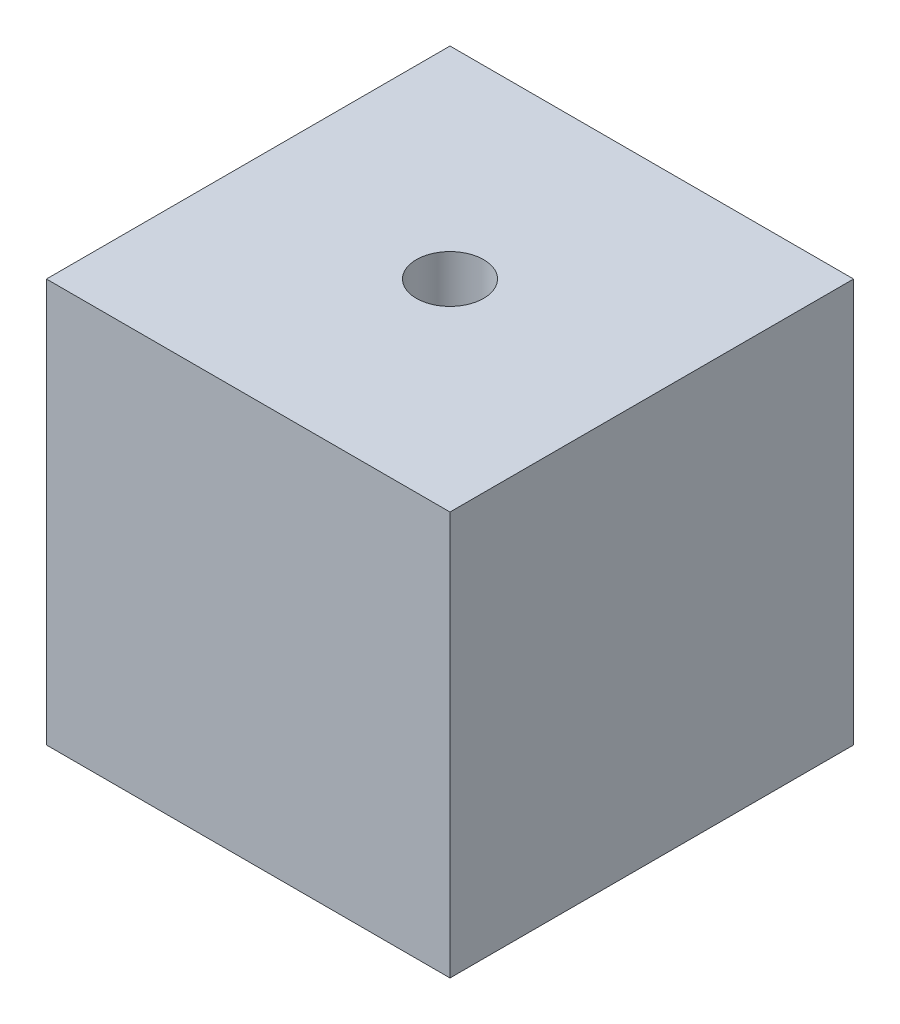
ISO-10303-21;
HEADER;
FILE_DESCRIPTION(('STEP AP214'),'2;1');
FILE_NAME('part.step','',(''),(''),'','','');
FILE_SCHEMA(('AUTOMOTIVE_DESIGN { 1 0 10303 214 1 1 1 1 }'));
ENDSEC;
DATA;
#1=APPLICATION_CONTEXT('core data for automotive mechanical design processes');
#2=APPLICATION_PROTOCOL_DEFINITION('international standard','automotive_design',2000,#1);
#3=PRODUCT_CONTEXT('',#1,'mechanical');
#4=PRODUCT('Part','Part','',(#3));
#5=PRODUCT_RELATED_PRODUCT_CATEGORY('part','',(#4));
#6=PRODUCT_DEFINITION_FORMATION('','',#4);
#7=PRODUCT_DEFINITION_CONTEXT('part definition',#1,'design');
#8=PRODUCT_DEFINITION('design','',#6,#7);
#9=PRODUCT_DEFINITION_SHAPE('','',#8);
#10=(LENGTH_UNIT() NAMED_UNIT(*) SI_UNIT(.MILLI.,.METRE.));
#11=(NAMED_UNIT(*) PLANE_ANGLE_UNIT() SI_UNIT($,.RADIAN.));
#12=(NAMED_UNIT(*) SI_UNIT($,.STERADIAN.) SOLID_ANGLE_UNIT());
#13=UNCERTAINTY_MEASURE_WITH_UNIT(LENGTH_MEASURE(1.E-05),#10,'distance_accuracy_value','');
#14=(GEOMETRIC_REPRESENTATION_CONTEXT(3) GLOBAL_UNCERTAINTY_ASSIGNED_CONTEXT((#13)) GLOBAL_UNIT_ASSIGNED_CONTEXT((#10,
#11,#12)) REPRESENTATION_CONTEXT('',''));
#15=CARTESIAN_POINT('',(0.,0.,0.));
#16=DIRECTION('',(0.,0.,1.));
#17=DIRECTION('',(1.,0.,0.));
#18=AXIS2_PLACEMENT_3D('',#15,#16,#17);
#19=CARTESIAN_POINT('',(0.,0.,38.1));
#20=DIRECTION('',(1.,0.,0.));
#21=DIRECTION('',(0.,1.,0.));
#22=AXIS2_PLACEMENT_3D('',#19,#20,#21);
#23=PLANE('',#22);
#24=DIRECTION('',(0.,-1.,0.));
#25=VECTOR('',#24,1.);
#26=CARTESIAN_POINT('',(0.,0.,0.));
#27=LINE('',#26,#25);
#28=CARTESIAN_POINT('',(0.,38.1,0.));
#29=VERTEX_POINT('',#28);
#30=CARTESIAN_POINT('',(0.,0.,0.));
#31=VERTEX_POINT('',#30);
#32=EDGE_CURVE('E111',#29,#31,#27,.T.);
#33=ORIENTED_EDGE('',*,*,#32,.T.);
#34=DIRECTION('',(0.,0.,-1.));
#35=VECTOR('',#34,1.);
#36=CARTESIAN_POINT('',(0.,0.,38.1));
#37=LINE('',#36,#35);
#38=CARTESIAN_POINT('',(0.,0.,38.1));
#39=VERTEX_POINT('',#38);
#40=EDGE_CURVE('E11',#39,#31,#37,.T.);
#41=ORIENTED_EDGE('',*,*,#40,.F.);
#42=DIRECTION('',(0.,-1.,0.));
#43=VECTOR('',#42,1.);
#44=CARTESIAN_POINT('',(0.,0.,38.1));
#45=LINE('',#44,#43);
#46=CARTESIAN_POINT('',(0.,38.1,38.1));
#47=VERTEX_POINT('',#46);
#48=EDGE_CURVE('E95',#47,#39,#45,.T.);
#49=ORIENTED_EDGE('',*,*,#48,.F.);
#50=DIRECTION('',(0.,0.,-1.));
#51=VECTOR('',#50,1.);
#52=CARTESIAN_POINT('',(0.,38.1,38.1));
#53=LINE('',#52,#51);
#54=EDGE_CURVE('E107',#47,#29,#53,.T.);
#55=ORIENTED_EDGE('',*,*,#54,.T.);
#56=EDGE_LOOP('',(#33,#41,#49,#55));
#57=FACE_BOUND('',#56,.T.);
#58=ADVANCED_FACE('F43',(#57),#23,.F.);
#59=CARTESIAN_POINT('',(0.,0.,38.1));
#60=DIRECTION('',(0.,1.,0.));
#61=DIRECTION('',(0.,0.,1.));
#62=AXIS2_PLACEMENT_3D('',#59,#60,#61);
#63=PLANE('',#62);
#64=CARTESIAN_POINT('',(19.05,0.,19.05));
#65=DIRECTION('',(0.,1.,0.));
#66=DIRECTION('',(0.,0.,1.));
#67=AXIS2_PLACEMENT_3D('',#64,#65,#66);
#68=CIRCLE('',#67,3.175);
#69=CARTESIAN_POINT('',(19.05,0.,22.225));
#70=VERTEX_POINT('',#69);
#71=EDGE_CURVE('E115',#70,#70,#68,.T.);
#72=ORIENTED_EDGE('',*,*,#71,.T.);
#73=EDGE_LOOP('',(#72));
#74=FACE_BOUND('',#73,.T.);
#75=DIRECTION('',(1.,0.,0.));
#76=VECTOR('',#75,1.);
#77=CARTESIAN_POINT('',(0.,0.,0.));
#78=LINE('',#77,#76);
#79=CARTESIAN_POINT('',(38.1,0.,0.));
#80=VERTEX_POINT('',#79);
#81=EDGE_CURVE('E100',#31,#80,#78,.T.);
#82=ORIENTED_EDGE('',*,*,#81,.T.);
#83=DIRECTION('',(0.,0.,-1.));
#84=VECTOR('',#83,1.);
#85=CARTESIAN_POINT('',(38.1,0.,38.1));
#86=LINE('',#85,#84);
#87=CARTESIAN_POINT('',(38.1,0.,38.1));
#88=VERTEX_POINT('',#87);
#89=EDGE_CURVE('E52',#88,#80,#86,.T.);
#90=ORIENTED_EDGE('',*,*,#89,.F.);
#91=DIRECTION('',(1.,0.,0.));
#92=VECTOR('',#91,1.);
#93=CARTESIAN_POINT('',(0.,0.,38.1));
#94=LINE('',#93,#92);
#95=EDGE_CURVE('E90',#39,#88,#94,.T.);
#96=ORIENTED_EDGE('',*,*,#95,.F.);
#97=ORIENTED_EDGE('',*,*,#40,.T.);
#98=EDGE_LOOP('',(#82,#90,#96,#97));
#99=FACE_BOUND('',#98,.T.);
#100=ADVANCED_FACE('F99',(#74,#99),#63,.F.);
#101=CARTESIAN_POINT('',(38.1,0.,38.1));
#102=DIRECTION('',(-1.,0.,0.));
#103=DIRECTION('',(0.,-1.,0.));
#104=AXIS2_PLACEMENT_3D('',#101,#102,#103);
#105=PLANE('',#104);
#106=DIRECTION('',(0.,1.,0.));
#107=VECTOR('',#106,1.);
#108=CARTESIAN_POINT('',(38.1,0.,0.));
#109=LINE('',#108,#107);
#110=CARTESIAN_POINT('',(38.1,38.1,0.));
#111=VERTEX_POINT('',#110);
#112=EDGE_CURVE('E77',#80,#111,#109,.T.);
#113=ORIENTED_EDGE('',*,*,#112,.T.);
#114=DIRECTION('',(0.,0.,-1.));
#115=VECTOR('',#114,1.);
#116=CARTESIAN_POINT('',(38.1,38.1,38.1));
#117=LINE('',#116,#115);
#118=CARTESIAN_POINT('',(38.1,38.1,38.1));
#119=VERTEX_POINT('',#118);
#120=EDGE_CURVE('E102',#119,#111,#117,.T.);
#121=ORIENTED_EDGE('',*,*,#120,.F.);
#122=DIRECTION('',(0.,1.,0.));
#123=VECTOR('',#122,1.);
#124=CARTESIAN_POINT('',(38.1,0.,38.1));
#125=LINE('',#124,#123);
#126=EDGE_CURVE('E93',#88,#119,#125,.T.);
#127=ORIENTED_EDGE('',*,*,#126,.F.);
#128=ORIENTED_EDGE('',*,*,#89,.T.);
#129=EDGE_LOOP('',(#113,#121,#127,#128));
#130=FACE_BOUND('',#129,.T.);
#131=ADVANCED_FACE('F103',(#130),#105,.F.);
#132=CARTESIAN_POINT('',(0.,38.1,38.1));
#133=DIRECTION('',(0.,-1.,0.));
#134=DIRECTION('',(0.,0.,-1.));
#135=AXIS2_PLACEMENT_3D('',#132,#133,#134);
#136=PLANE('',#135);
#137=CARTESIAN_POINT('',(19.05,38.1,19.05));
#138=DIRECTION('',(0.,1.,0.));
#139=DIRECTION('',(0.,0.,1.));
#140=AXIS2_PLACEMENT_3D('',#137,#138,#139);
#141=CIRCLE('',#140,3.175);
#142=CARTESIAN_POINT('',(19.05,38.1,22.225));
#143=VERTEX_POINT('',#142);
#144=EDGE_CURVE('E132',#143,#143,#141,.T.);
#145=ORIENTED_EDGE('',*,*,#144,.F.);
#146=EDGE_LOOP('',(#145));
#147=FACE_BOUND('',#146,.T.);
#148=DIRECTION('',(-1.,0.,0.));
#149=VECTOR('',#148,1.);
#150=CARTESIAN_POINT('',(0.,38.1,0.));
#151=LINE('',#150,#149);
#152=EDGE_CURVE('E83',#111,#29,#151,.T.);
#153=ORIENTED_EDGE('',*,*,#152,.T.);
#154=ORIENTED_EDGE('',*,*,#54,.F.);
#155=DIRECTION('',(-1.,0.,0.));
#156=VECTOR('',#155,1.);
#157=CARTESIAN_POINT('',(0.,38.1,38.1));
#158=LINE('',#157,#156);
#159=EDGE_CURVE('E60',#119,#47,#158,.T.);
#160=ORIENTED_EDGE('',*,*,#159,.F.);
#161=ORIENTED_EDGE('',*,*,#120,.T.);
#162=EDGE_LOOP('',(#153,#154,#160,#161));
#163=FACE_BOUND('',#162,.T.);
#164=ADVANCED_FACE('F125',(#147,#163),#136,.F.);
#165=CARTESIAN_POINT('',(0.,0.,38.1));
#166=DIRECTION('',(0.,0.,-1.));
#167=DIRECTION('',(-1.,0.,0.));
#168=AXIS2_PLACEMENT_3D('',#165,#166,#167);
#169=PLANE('',#168);
#170=ORIENTED_EDGE('',*,*,#48,.T.);
#171=ORIENTED_EDGE('',*,*,#95,.T.);
#172=ORIENTED_EDGE('',*,*,#126,.T.);
#173=ORIENTED_EDGE('',*,*,#159,.T.);
#174=EDGE_LOOP('',(#170,#171,#172,#173));
#175=FACE_BOUND('',#174,.T.);
#176=ADVANCED_FACE('F91',(#175),#169,.F.);
#177=CARTESIAN_POINT('',(0.,0.,0.));
#178=DIRECTION('',(0.,0.,-1.));
#179=DIRECTION('',(-1.,0.,0.));
#180=AXIS2_PLACEMENT_3D('',#177,#178,#179);
#181=PLANE('',#180);
#182=ORIENTED_EDGE('',*,*,#32,.F.);
#183=ORIENTED_EDGE('',*,*,#152,.F.);
#184=ORIENTED_EDGE('',*,*,#112,.F.);
#185=ORIENTED_EDGE('',*,*,#81,.F.);
#186=EDGE_LOOP('',(#182,#183,#184,#185));
#187=FACE_BOUND('',#186,.T.);
#188=ADVANCED_FACE('F128',(#187),#181,.T.);
#189=CARTESIAN_POINT('',(19.05,0.,19.05));
#190=DIRECTION('',(0.,1.,0.));
#191=DIRECTION('',(0.,0.,1.));
#192=AXIS2_PLACEMENT_3D('',#189,#190,#191);
#193=CYLINDRICAL_SURFACE('',#192,3.175);
#194=ORIENTED_EDGE('',*,*,#71,.F.);
#195=EDGE_LOOP('',(#194));
#196=FACE_BOUND('',#195,.T.);
#197=ORIENTED_EDGE('',*,*,#144,.T.);
#198=EDGE_LOOP('',(#197));
#199=FACE_BOUND('',#198,.T.);
#200=ADVANCED_FACE('F141',(#196,#199),#193,.F.);
#201=CLOSED_SHELL('',(#58,#100,#131,#164,#176,#188,#200));
#202=MANIFOLD_SOLID_BREP('B2',#201);
#203=ADVANCED_BREP_SHAPE_REPRESENTATION('',(#18,#202),#14);
#204=SHAPE_DEFINITION_REPRESENTATION(#9,#203);
ENDSEC;
END-ISO-10303-21;
